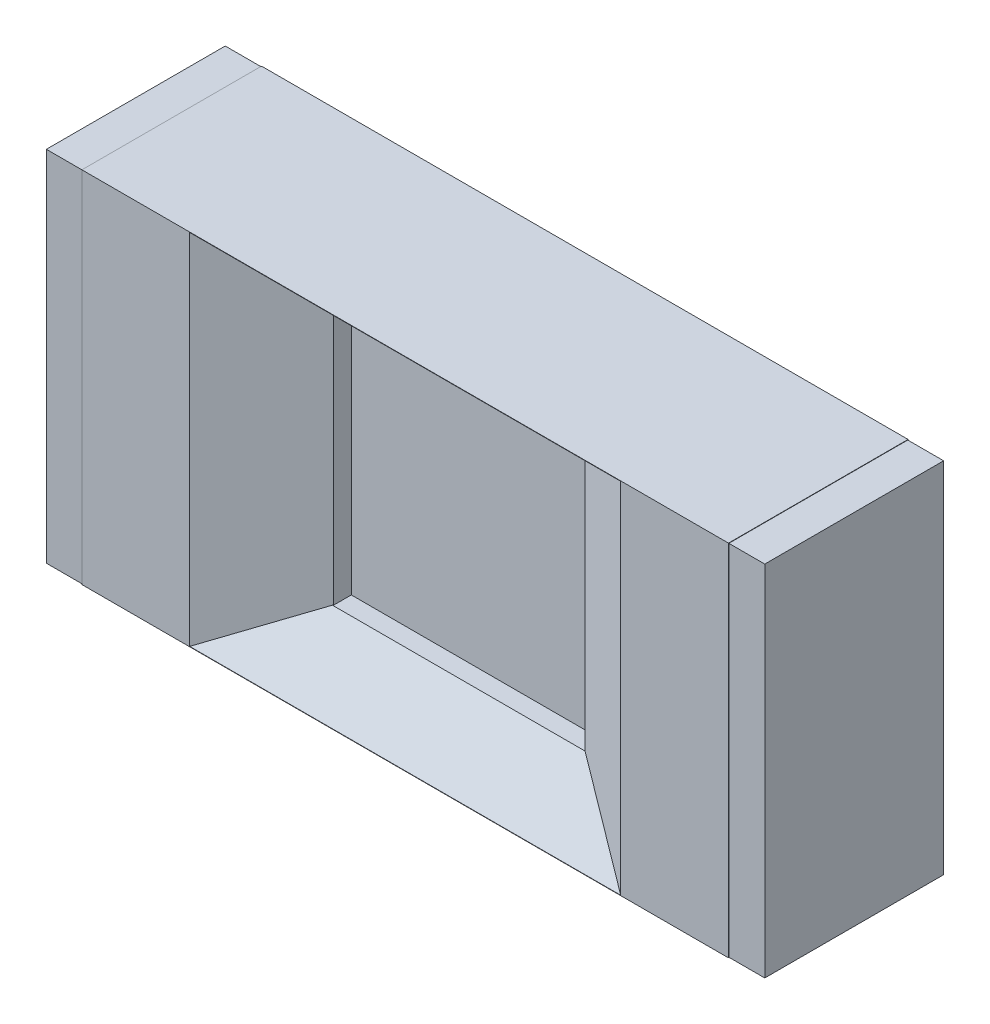
ISO-10303-21;
HEADER;
FILE_DESCRIPTION(('STEP AP214'),'2;1');
FILE_NAME('part.step','',(''),(''),'','','');
FILE_SCHEMA(('AUTOMOTIVE_DESIGN { 1 0 10303 214 1 1 1 1 }'));
ENDSEC;
DATA;
#1=APPLICATION_CONTEXT('core data for automotive mechanical design processes');
#2=APPLICATION_PROTOCOL_DEFINITION('international standard','automotive_design',2000,#1);
#3=PRODUCT_CONTEXT('',#1,'mechanical');
#4=PRODUCT('Part','Part','',(#3));
#5=PRODUCT_RELATED_PRODUCT_CATEGORY('part','',(#4));
#6=PRODUCT_DEFINITION_FORMATION('','',#4);
#7=PRODUCT_DEFINITION_CONTEXT('part definition',#1,'design');
#8=PRODUCT_DEFINITION('design','',#6,#7);
#9=PRODUCT_DEFINITION_SHAPE('','',#8);
#10=(LENGTH_UNIT() NAMED_UNIT(*) SI_UNIT(.MILLI.,.METRE.));
#11=(NAMED_UNIT(*) PLANE_ANGLE_UNIT() SI_UNIT($,.RADIAN.));
#12=(NAMED_UNIT(*) SI_UNIT($,.STERADIAN.) SOLID_ANGLE_UNIT());
#13=UNCERTAINTY_MEASURE_WITH_UNIT(LENGTH_MEASURE(1.E-05),#10,'distance_accuracy_value','');
#14=(GEOMETRIC_REPRESENTATION_CONTEXT(3) GLOBAL_UNCERTAINTY_ASSIGNED_CONTEXT((#13)) GLOBAL_UNIT_ASSIGNED_CONTEXT((#10,
#11,#12)) REPRESENTATION_CONTEXT('',''));
#15=CARTESIAN_POINT('',(0.,0.,0.));
#16=DIRECTION('',(0.,0.,1.));
#17=DIRECTION('',(1.,0.,0.));
#18=AXIS2_PLACEMENT_3D('',#15,#16,#17);
#19=CARTESIAN_POINT('',(28.13,-12.,3.201));
#20=DIRECTION('',(0.,0.,-1.));
#21=DIRECTION('',(0.,-1.,0.));
#22=AXIS2_PLACEMENT_3D('',#19,#20,#21);
#23=PLANE('',#22);
#24=DIRECTION('',(1.,0.,0.));
#25=VECTOR('',#24,1.);
#26=CARTESIAN_POINT('',(28.13,-11.999,3.201));
#27=LINE('',#26,#25);
#28=CARTESIAN_POINT('',(28.03,-11.999,3.201));
#29=VERTEX_POINT('',#28);
#30=CARTESIAN_POINT('',(28.13,-11.999,3.201));
#31=VERTEX_POINT('',#30);
#32=EDGE_CURVE('E257',#29,#31,#27,.T.);
#33=ORIENTED_EDGE('',*,*,#32,.F.);
#34=DIRECTION('',(0.,-1.,0.));
#35=VECTOR('',#34,1.);
#36=CARTESIAN_POINT('',(28.03,-12.,3.201));
#37=LINE('',#36,#35);
#38=CARTESIAN_POINT('',(28.03,-11.001,3.201));
#39=VERTEX_POINT('',#38);
#40=EDGE_CURVE('E11',#39,#29,#37,.T.);
#41=ORIENTED_EDGE('',*,*,#40,.F.);
#42=DIRECTION('',(1.,0.,0.));
#43=VECTOR('',#42,1.);
#44=CARTESIAN_POINT('',(28.13,-11.001,3.201));
#45=LINE('',#44,#43);
#46=CARTESIAN_POINT('',(28.13,-11.001,3.201));
#47=VERTEX_POINT('',#46);
#48=EDGE_CURVE('E260',#39,#47,#45,.T.);
#49=ORIENTED_EDGE('',*,*,#48,.T.);
#50=DIRECTION('',(0.,-1.,0.));
#51=VECTOR('',#50,1.);
#52=CARTESIAN_POINT('',(28.13,-12.,3.201));
#53=LINE('',#52,#51);
#54=EDGE_CURVE('E288',#47,#31,#53,.T.);
#55=ORIENTED_EDGE('',*,*,#54,.T.);
#56=EDGE_LOOP('',(#33,#41,#49,#55));
#57=FACE_BOUND('',#56,.T.);
#58=ADVANCED_FACE('F18',(#57),#23,.T.);
#59=CARTESIAN_POINT('',(28.03,-12.,3.2));
#60=DIRECTION('',(-1.,0.,0.));
#61=DIRECTION('',(0.,0.,1.));
#62=AXIS2_PLACEMENT_3D('',#59,#60,#61);
#63=PLANE('',#62);
#64=ORIENTED_EDGE('',*,*,#40,.T.);
#65=DIRECTION('',(0.,0.,1.));
#66=VECTOR('',#65,1.);
#67=CARTESIAN_POINT('',(28.03,-11.999,3.2));
#68=LINE('',#67,#66);
#69=CARTESIAN_POINT('',(28.03,-11.999,3.699));
#70=VERTEX_POINT('',#69);
#71=EDGE_CURVE('E261',#29,#70,#68,.T.);
#72=ORIENTED_EDGE('',*,*,#71,.T.);
#73=DIRECTION('',(0.,1.,0.));
#74=VECTOR('',#73,1.);
#75=CARTESIAN_POINT('',(28.03,-12.,3.699));
#76=LINE('',#75,#74);
#77=CARTESIAN_POINT('',(28.03,-11.001,3.699));
#78=VERTEX_POINT('',#77);
#79=EDGE_CURVE('E298',#70,#78,#76,.T.);
#80=ORIENTED_EDGE('',*,*,#79,.T.);
#81=DIRECTION('',(0.,0.,-1.));
#82=VECTOR('',#81,1.);
#83=CARTESIAN_POINT('',(28.03,-11.001,3.2));
#84=LINE('',#83,#82);
#85=EDGE_CURVE('E28',#78,#39,#84,.T.);
#86=ORIENTED_EDGE('',*,*,#85,.T.);
#87=EDGE_LOOP('',(#64,#72,#80,#86));
#88=FACE_BOUND('',#87,.T.);
#89=ADVANCED_FACE('F487',(#88),#63,.T.);
#90=CARTESIAN_POINT('',(28.13,-11.001,3.2));
#91=DIRECTION('',(0.,1.,0.));
#92=DIRECTION('',(1.,0.,0.));
#93=AXIS2_PLACEMENT_3D('',#90,#91,#92);
#94=PLANE('',#93);
#95=ORIENTED_EDGE('',*,*,#48,.F.);
#96=ORIENTED_EDGE('',*,*,#85,.F.);
#97=DIRECTION('',(1.,0.,0.));
#98=VECTOR('',#97,1.);
#99=CARTESIAN_POINT('',(28.13,-11.001,3.699));
#100=LINE('',#99,#98);
#101=CARTESIAN_POINT('',(28.13,-11.001,3.699));
#102=VERTEX_POINT('',#101);
#103=EDGE_CURVE('E295',#78,#102,#100,.T.);
#104=ORIENTED_EDGE('',*,*,#103,.T.);
#105=DIRECTION('',(0.,0.,-1.));
#106=VECTOR('',#105,1.);
#107=CARTESIAN_POINT('',(28.13,-11.001,3.2));
#108=LINE('',#107,#106);
#109=EDGE_CURVE('E299',#102,#47,#108,.T.);
#110=ORIENTED_EDGE('',*,*,#109,.T.);
#111=EDGE_LOOP('',(#95,#96,#104,#110));
#112=FACE_BOUND('',#111,.T.);
#113=ADVANCED_FACE('F490',(#112),#94,.T.);
#114=CARTESIAN_POINT('',(28.13,-11.999,3.2));
#115=DIRECTION('',(0.,-1.,0.));
#116=DIRECTION('',(-1.,0.,0.));
#117=AXIS2_PLACEMENT_3D('',#114,#115,#116);
#118=PLANE('',#117);
#119=DIRECTION('',(1.,0.,0.));
#120=VECTOR('',#119,1.);
#121=CARTESIAN_POINT('',(28.13,-11.999,3.699));
#122=LINE('',#121,#120);
#123=CARTESIAN_POINT('',(28.13,-11.999,3.699));
#124=VERTEX_POINT('',#123);
#125=EDGE_CURVE('E267',#70,#124,#122,.T.);
#126=ORIENTED_EDGE('',*,*,#125,.F.);
#127=ORIENTED_EDGE('',*,*,#71,.F.);
#128=ORIENTED_EDGE('',*,*,#32,.T.);
#129=DIRECTION('',(0.,0.,1.));
#130=VECTOR('',#129,1.);
#131=CARTESIAN_POINT('',(28.13,-11.999,3.2));
#132=LINE('',#131,#130);
#133=EDGE_CURVE('E284',#31,#124,#132,.T.);
#134=ORIENTED_EDGE('',*,*,#133,.T.);
#135=EDGE_LOOP('',(#126,#127,#128,#134));
#136=FACE_BOUND('',#135,.T.);
#137=ADVANCED_FACE('F498',(#136),#118,.T.);
#138=CARTESIAN_POINT('',(28.13,-12.,3.699));
#139=DIRECTION('',(0.,0.,1.));
#140=DIRECTION('',(1.,0.,0.));
#141=AXIS2_PLACEMENT_3D('',#138,#139,#140);
#142=PLANE('',#141);
#143=ORIENTED_EDGE('',*,*,#103,.F.);
#144=ORIENTED_EDGE('',*,*,#79,.F.);
#145=ORIENTED_EDGE('',*,*,#125,.T.);
#146=DIRECTION('',(0.,1.,0.));
#147=VECTOR('',#146,1.);
#148=CARTESIAN_POINT('',(28.13,-12.,3.699));
#149=LINE('',#148,#147);
#150=EDGE_CURVE('E279',#124,#102,#149,.T.);
#151=ORIENTED_EDGE('',*,*,#150,.T.);
#152=EDGE_LOOP('',(#143,#144,#145,#151));
#153=FACE_BOUND('',#152,.T.);
#154=ADVANCED_FACE('F507',(#153),#142,.T.);
#155=CARTESIAN_POINT('',(28.13,-11.5,3.45));
#156=DIRECTION('',(-1.,0.,0.));
#157=DIRECTION('',(0.,0.,1.));
#158=AXIS2_PLACEMENT_3D('',#155,#156,#157);
#159=PLANE('',#158);
#160=ORIENTED_EDGE('',*,*,#150,.F.);
#161=ORIENTED_EDGE('',*,*,#133,.F.);
#162=ORIENTED_EDGE('',*,*,#54,.F.);
#163=ORIENTED_EDGE('',*,*,#109,.F.);
#164=EDGE_LOOP('',(#160,#161,#162,#163));
#165=FACE_BOUND('',#164,.T.);
#166=DIRECTION('',(0.,1.,0.));
#167=VECTOR('',#166,1.);
#168=CARTESIAN_POINT('',(28.13,-12.,3.7));
#169=LINE('',#168,#167);
#170=CARTESIAN_POINT('',(28.13,-12.,3.7));
#171=VERTEX_POINT('',#170);
#172=CARTESIAN_POINT('',(28.13,-11.,3.7));
#173=VERTEX_POINT('',#172);
#174=EDGE_CURVE('E334',#171,#173,#169,.T.);
#175=ORIENTED_EDGE('',*,*,#174,.T.);
#176=DIRECTION('',(0.,0.,-1.));
#177=VECTOR('',#176,1.);
#178=CARTESIAN_POINT('',(28.13,-11.,3.2));
#179=LINE('',#178,#177);
#180=CARTESIAN_POINT('',(28.13,-11.,3.2));
#181=VERTEX_POINT('',#180);
#182=EDGE_CURVE('E186',#173,#181,#179,.T.);
#183=ORIENTED_EDGE('',*,*,#182,.T.);
#184=DIRECTION('',(0.,-1.,0.));
#185=VECTOR('',#184,1.);
#186=CARTESIAN_POINT('',(28.13,-12.,3.2));
#187=LINE('',#186,#185);
#188=CARTESIAN_POINT('',(28.13,-12.,3.2));
#189=VERTEX_POINT('',#188);
#190=EDGE_CURVE('E321',#181,#189,#187,.T.);
#191=ORIENTED_EDGE('',*,*,#190,.T.);
#192=DIRECTION('',(0.,0.,1.));
#193=VECTOR('',#192,1.);
#194=CARTESIAN_POINT('',(28.13,-12.,3.2));
#195=LINE('',#194,#193);
#196=EDGE_CURVE('E196',#189,#171,#195,.T.);
#197=ORIENTED_EDGE('',*,*,#196,.T.);
#198=EDGE_LOOP('',(#175,#183,#191,#197));
#199=FACE_BOUND('',#198,.T.);
#200=ADVANCED_FACE('F473',(#165,#199),#159,.T.);
#201=CARTESIAN_POINT('',(29.93,-12.,3.201));
#202=DIRECTION('',(0.,0.,-1.));
#203=DIRECTION('',(-1.,0.,0.));
#204=AXIS2_PLACEMENT_3D('',#201,#202,#203);
#205=PLANE('',#204);
#206=DIRECTION('',(0.,-1.,0.));
#207=VECTOR('',#206,1.);
#208=CARTESIAN_POINT('',(29.93,-12.,3.201));
#209=LINE('',#208,#207);
#210=CARTESIAN_POINT('',(29.93,-11.001,3.201));
#211=VERTEX_POINT('',#210);
#212=CARTESIAN_POINT('',(29.93,-11.999,3.201));
#213=VERTEX_POINT('',#212);
#214=EDGE_CURVE('E275',#211,#213,#209,.T.);
#215=ORIENTED_EDGE('',*,*,#214,.F.);
#216=DIRECTION('',(-1.,0.,0.));
#217=VECTOR('',#216,1.);
#218=CARTESIAN_POINT('',(29.93,-11.001,3.201));
#219=LINE('',#218,#217);
#220=CARTESIAN_POINT('',(30.03,-11.001,3.201));
#221=VERTEX_POINT('',#220);
#222=EDGE_CURVE('E280',#221,#211,#219,.T.);
#223=ORIENTED_EDGE('',*,*,#222,.F.);
#224=DIRECTION('',(0.,-1.,0.));
#225=VECTOR('',#224,1.);
#226=CARTESIAN_POINT('',(30.03,-12.,3.201));
#227=LINE('',#226,#225);
#228=CARTESIAN_POINT('',(30.03,-11.999,3.201));
#229=VERTEX_POINT('',#228);
#230=EDGE_CURVE('E276',#221,#229,#227,.T.);
#231=ORIENTED_EDGE('',*,*,#230,.T.);
#232=DIRECTION('',(-1.,0.,0.));
#233=VECTOR('',#232,1.);
#234=CARTESIAN_POINT('',(29.93,-11.999,3.201));
#235=LINE('',#234,#233);
#236=EDGE_CURVE('E300',#229,#213,#235,.T.);
#237=ORIENTED_EDGE('',*,*,#236,.T.);
#238=EDGE_LOOP('',(#215,#223,#231,#237));
#239=FACE_BOUND('',#238,.T.);
#240=ADVANCED_FACE('F514',(#239),#205,.T.);
#241=CARTESIAN_POINT('',(30.03,-11.,3.2));
#242=DIRECTION('',(1.,0.,0.));
#243=DIRECTION('',(0.,1.,0.));
#244=AXIS2_PLACEMENT_3D('',#241,#242,#243);
#245=PLANE('',#244);
#246=ORIENTED_EDGE('',*,*,#230,.F.);
#247=DIRECTION('',(0.,0.,-1.));
#248=VECTOR('',#247,1.);
#249=CARTESIAN_POINT('',(30.03,-11.001,3.2));
#250=LINE('',#249,#248);
#251=CARTESIAN_POINT('',(30.03,-11.001,3.699));
#252=VERTEX_POINT('',#251);
#253=EDGE_CURVE('E400',#252,#221,#250,.T.);
#254=ORIENTED_EDGE('',*,*,#253,.F.);
#255=DIRECTION('',(0.,1.,0.));
#256=VECTOR('',#255,1.);
#257=CARTESIAN_POINT('',(30.03,-12.,3.699));
#258=LINE('',#257,#256);
#259=CARTESIAN_POINT('',(30.03,-11.999,3.699));
#260=VERTEX_POINT('',#259);
#261=EDGE_CURVE('E308',#260,#252,#258,.T.);
#262=ORIENTED_EDGE('',*,*,#261,.F.);
#263=DIRECTION('',(0.,0.,1.));
#264=VECTOR('',#263,1.);
#265=CARTESIAN_POINT('',(30.03,-11.999,3.2));
#266=LINE('',#265,#264);
#267=EDGE_CURVE('E21',#229,#260,#266,.T.);
#268=ORIENTED_EDGE('',*,*,#267,.F.);
#269=EDGE_LOOP('',(#246,#254,#262,#268));
#270=FACE_BOUND('',#269,.T.);
#271=ADVANCED_FACE('F534',(#270),#245,.T.);
#272=CARTESIAN_POINT('',(29.93,-11.001,3.2));
#273=DIRECTION('',(0.,1.,0.));
#274=DIRECTION('',(1.,0.,0.));
#275=AXIS2_PLACEMENT_3D('',#272,#273,#274);
#276=PLANE('',#275);
#277=DIRECTION('',(0.,0.,-1.));
#278=VECTOR('',#277,1.);
#279=CARTESIAN_POINT('',(29.93,-11.001,3.2));
#280=LINE('',#279,#278);
#281=CARTESIAN_POINT('',(29.93,-11.001,3.699));
#282=VERTEX_POINT('',#281);
#283=EDGE_CURVE('E342',#282,#211,#280,.T.);
#284=ORIENTED_EDGE('',*,*,#283,.F.);
#285=DIRECTION('',(-1.,0.,0.));
#286=VECTOR('',#285,1.);
#287=CARTESIAN_POINT('',(29.93,-11.001,3.699));
#288=LINE('',#287,#286);
#289=EDGE_CURVE('E303',#252,#282,#288,.T.);
#290=ORIENTED_EDGE('',*,*,#289,.F.);
#291=ORIENTED_EDGE('',*,*,#253,.T.);
#292=ORIENTED_EDGE('',*,*,#222,.T.);
#293=EDGE_LOOP('',(#284,#290,#291,#292));
#294=FACE_BOUND('',#293,.T.);
#295=ADVANCED_FACE('F537',(#294),#276,.T.);
#296=CARTESIAN_POINT('',(29.93,-11.999,3.2));
#297=DIRECTION('',(0.,-1.,0.));
#298=DIRECTION('',(0.,0.,-1.));
#299=AXIS2_PLACEMENT_3D('',#296,#297,#298);
#300=PLANE('',#299);
#301=DIRECTION('',(0.,0.,1.));
#302=VECTOR('',#301,1.);
#303=CARTESIAN_POINT('',(29.93,-11.999,3.2));
#304=LINE('',#303,#302);
#305=CARTESIAN_POINT('',(29.93,-11.999,3.699));
#306=VERTEX_POINT('',#305);
#307=EDGE_CURVE('E270',#213,#306,#304,.T.);
#308=ORIENTED_EDGE('',*,*,#307,.F.);
#309=ORIENTED_EDGE('',*,*,#236,.F.);
#310=ORIENTED_EDGE('',*,*,#267,.T.);
#311=DIRECTION('',(-1.,0.,0.));
#312=VECTOR('',#311,1.);
#313=CARTESIAN_POINT('',(29.93,-11.999,3.699));
#314=LINE('',#313,#312);
#315=EDGE_CURVE('E274',#260,#306,#314,.T.);
#316=ORIENTED_EDGE('',*,*,#315,.T.);
#317=EDGE_LOOP('',(#308,#309,#310,#316));
#318=FACE_BOUND('',#317,.T.);
#319=ADVANCED_FACE('F518',(#318),#300,.T.);
#320=CARTESIAN_POINT('',(29.93,-12.,3.699));
#321=DIRECTION('',(0.,0.,1.));
#322=DIRECTION('',(1.,0.,0.));
#323=AXIS2_PLACEMENT_3D('',#320,#321,#322);
#324=PLANE('',#323);
#325=DIRECTION('',(0.,1.,0.));
#326=VECTOR('',#325,1.);
#327=CARTESIAN_POINT('',(29.93,-12.,3.699));
#328=LINE('',#327,#326);
#329=EDGE_CURVE('E347',#306,#282,#328,.T.);
#330=ORIENTED_EDGE('',*,*,#329,.F.);
#331=ORIENTED_EDGE('',*,*,#315,.F.);
#332=ORIENTED_EDGE('',*,*,#261,.T.);
#333=ORIENTED_EDGE('',*,*,#289,.T.);
#334=EDGE_LOOP('',(#330,#331,#332,#333));
#335=FACE_BOUND('',#334,.T.);
#336=ADVANCED_FACE('F546',(#335),#324,.T.);
#337=CARTESIAN_POINT('',(29.93,-11.5,3.45));
#338=DIRECTION('',(1.,0.,0.));
#339=DIRECTION('',(0.,1.,0.));
#340=AXIS2_PLACEMENT_3D('',#337,#338,#339);
#341=PLANE('',#340);
#342=ORIENTED_EDGE('',*,*,#329,.T.);
#343=ORIENTED_EDGE('',*,*,#283,.T.);
#344=ORIENTED_EDGE('',*,*,#214,.T.);
#345=ORIENTED_EDGE('',*,*,#307,.T.);
#346=EDGE_LOOP('',(#342,#343,#344,#345));
#347=FACE_BOUND('',#346,.T.);
#348=DIRECTION('',(0.,1.,0.));
#349=VECTOR('',#348,1.);
#350=CARTESIAN_POINT('',(29.93,-12.,3.7));
#351=LINE('',#350,#349);
#352=CARTESIAN_POINT('',(29.93,-12.,3.7));
#353=VERTEX_POINT('',#352);
#354=CARTESIAN_POINT('',(29.93,-11.,3.7));
#355=VERTEX_POINT('',#354);
#356=EDGE_CURVE('E312',#353,#355,#351,.T.);
#357=ORIENTED_EDGE('',*,*,#356,.F.);
#358=DIRECTION('',(0.,0.,1.));
#359=VECTOR('',#358,1.);
#360=CARTESIAN_POINT('',(29.93,-12.,3.2));
#361=LINE('',#360,#359);
#362=CARTESIAN_POINT('',(29.93,-12.,3.2));
#363=VERTEX_POINT('',#362);
#364=EDGE_CURVE('E293',#363,#353,#361,.T.);
#365=ORIENTED_EDGE('',*,*,#364,.F.);
#366=DIRECTION('',(0.,-1.,0.));
#367=VECTOR('',#366,1.);
#368=CARTESIAN_POINT('',(29.93,-12.,3.2));
#369=LINE('',#368,#367);
#370=CARTESIAN_POINT('',(29.93,-11.,3.2));
#371=VERTEX_POINT('',#370);
#372=EDGE_CURVE('E221',#371,#363,#369,.T.);
#373=ORIENTED_EDGE('',*,*,#372,.F.);
#374=DIRECTION('',(0.,0.,-1.));
#375=VECTOR('',#374,1.);
#376=CARTESIAN_POINT('',(29.93,-11.,3.2));
#377=LINE('',#376,#375);
#378=EDGE_CURVE('E178',#355,#371,#377,.T.);
#379=ORIENTED_EDGE('',*,*,#378,.F.);
#380=EDGE_LOOP('',(#357,#365,#373,#379));
#381=FACE_BOUND('',#380,.T.);
#382=ADVANCED_FACE('F467',(#347,#381),#341,.T.);
#383=CARTESIAN_POINT('',(29.03,-11.5,3.5));
#384=DIRECTION('',(0.,0.,-1.));
#385=DIRECTION('',(0.,-1.,0.));
#386=AXIS2_PLACEMENT_3D('',#383,#384,#385);
#387=PLANE('',#386);
#388=DIRECTION('',(0.,1.,0.));
#389=VECTOR('',#388,1.);
#390=CARTESIAN_POINT('',(28.68,-11.85,3.5));
#391=LINE('',#390,#389);
#392=CARTESIAN_POINT('',(28.68,-11.85,3.5));
#393=VERTEX_POINT('',#392);
#394=CARTESIAN_POINT('',(28.68,-11.15,3.5));
#395=VERTEX_POINT('',#394);
#396=EDGE_CURVE('E215',#393,#395,#391,.T.);
#397=ORIENTED_EDGE('',*,*,#396,.F.);
#398=DIRECTION('',(-1.,0.,0.));
#399=VECTOR('',#398,1.);
#400=CARTESIAN_POINT('',(29.38,-11.85,3.5));
#401=LINE('',#400,#399);
#402=CARTESIAN_POINT('',(29.38,-11.85,3.5));
#403=VERTEX_POINT('',#402);
#404=EDGE_CURVE('E339',#403,#393,#401,.T.);
#405=ORIENTED_EDGE('',*,*,#404,.F.);
#406=DIRECTION('',(0.,-1.,0.));
#407=VECTOR('',#406,1.);
#408=CARTESIAN_POINT('',(29.38,-11.15,3.5));
#409=LINE('',#408,#407);
#410=CARTESIAN_POINT('',(29.38,-11.15,3.5));
#411=VERTEX_POINT('',#410);
#412=EDGE_CURVE('E350',#411,#403,#409,.T.);
#413=ORIENTED_EDGE('',*,*,#412,.F.);
#414=DIRECTION('',(1.,0.,0.));
#415=VECTOR('',#414,1.);
#416=CARTESIAN_POINT('',(28.68,-11.15,3.5));
#417=LINE('',#416,#415);
#418=EDGE_CURVE('E220',#395,#411,#417,.T.);
#419=ORIENTED_EDGE('',*,*,#418,.F.);
#420=EDGE_LOOP('',(#397,#405,#413,#419));
#421=FACE_BOUND('',#420,.T.);
#422=ADVANCED_FACE('F452',(#421),#387,.F.);
#423=CARTESIAN_POINT('',(29.38,-11.15,3.7));
#424=DIRECTION('',(-1.,0.,0.));
#425=DIRECTION('',(0.,0.,1.));
#426=AXIS2_PLACEMENT_3D('',#423,#424,#425);
#427=PLANE('',#426);
#428=DIRECTION('',(0.,0.,-1.));
#429=VECTOR('',#428,1.);
#430=CARTESIAN_POINT('',(29.38,-11.15,3.7));
#431=LINE('',#430,#429);
#432=CARTESIAN_POINT('',(29.38,-11.15,3.55));
#433=VERTEX_POINT('',#432);
#434=EDGE_CURVE('E329',#433,#411,#431,.T.);
#435=ORIENTED_EDGE('',*,*,#434,.T.);
#436=ORIENTED_EDGE('',*,*,#412,.T.);
#437=DIRECTION('',(0.,0.,-1.));
#438=VECTOR('',#437,1.);
#439=CARTESIAN_POINT('',(29.38,-11.85,3.7));
#440=LINE('',#439,#438);
#441=CARTESIAN_POINT('',(29.38,-11.85,3.55));
#442=VERTEX_POINT('',#441);
#443=EDGE_CURVE('E335',#442,#403,#440,.T.);
#444=ORIENTED_EDGE('',*,*,#443,.F.);
#445=DIRECTION('',(0.,-1.,0.));
#446=VECTOR('',#445,1.);
#447=CARTESIAN_POINT('',(29.38,-11.15,3.55));
#448=LINE('',#447,#446);
#449=EDGE_CURVE('E249',#433,#442,#448,.T.);
#450=ORIENTED_EDGE('',*,*,#449,.F.);
#451=EDGE_LOOP('',(#435,#436,#444,#450));
#452=FACE_BOUND('',#451,.T.);
#453=ADVANCED_FACE('F449',(#452),#427,.T.);
#454=CARTESIAN_POINT('',(28.68,-11.85,3.7));
#455=DIRECTION('',(1.,0.,0.));
#456=DIRECTION('',(0.,1.,0.));
#457=AXIS2_PLACEMENT_3D('',#454,#455,#456);
#458=PLANE('',#457);
#459=DIRECTION('',(0.,0.,-1.));
#460=VECTOR('',#459,1.);
#461=CARTESIAN_POINT('',(28.68,-11.85,3.7));
#462=LINE('',#461,#460);
#463=CARTESIAN_POINT('',(28.68,-11.85,3.55));
#464=VERTEX_POINT('',#463);
#465=EDGE_CURVE('E363',#464,#393,#462,.T.);
#466=ORIENTED_EDGE('',*,*,#465,.T.);
#467=ORIENTED_EDGE('',*,*,#396,.T.);
#468=DIRECTION('',(0.,0.,-1.));
#469=VECTOR('',#468,1.);
#470=CARTESIAN_POINT('',(28.68,-11.15,3.7));
#471=LINE('',#470,#469);
#472=CARTESIAN_POINT('',(28.68,-11.15,3.55));
#473=VERTEX_POINT('',#472);
#474=EDGE_CURVE('E209',#473,#395,#471,.T.);
#475=ORIENTED_EDGE('',*,*,#474,.F.);
#476=DIRECTION('',(0.,1.,0.));
#477=VECTOR('',#476,1.);
#478=CARTESIAN_POINT('',(28.68,-11.85,3.55));
#479=LINE('',#478,#477);
#480=EDGE_CURVE('E214',#464,#473,#479,.T.);
#481=ORIENTED_EDGE('',*,*,#480,.F.);
#482=EDGE_LOOP('',(#466,#467,#475,#481));
#483=FACE_BOUND('',#482,.T.);
#484=ADVANCED_FACE('F212',(#483),#458,.T.);
#485=CARTESIAN_POINT('',(29.38,-11.85,3.7));
#486=DIRECTION('',(0.,1.,0.));
#487=DIRECTION('',(1.,0.,0.));
#488=AXIS2_PLACEMENT_3D('',#485,#486,#487);
#489=PLANE('',#488);
#490=DIRECTION('',(-0.857492925712456,0.,-0.514495755427674));
#491=VECTOR('',#490,1.);
#492=CARTESIAN_POINT('',(29.475588235294,-11.85,3.607352941176));
#493=LINE('',#492,#491);
#494=CARTESIAN_POINT('',(29.381666666666,-11.85,3.551));
#495=VERTEX_POINT('',#494);
#496=EDGE_CURVE('E304',#495,#442,#493,.T.);
#497=ORIENTED_EDGE('',*,*,#496,.T.);
#498=ORIENTED_EDGE('',*,*,#443,.T.);
#499=ORIENTED_EDGE('',*,*,#404,.T.);
#500=ORIENTED_EDGE('',*,*,#465,.F.);
#501=DIRECTION('',(0.857492925712456,0.,-0.514495755427674));
#502=VECTOR('',#501,1.);
#503=CARTESIAN_POINT('',(28.841764705882,-11.85,3.452941176471));
#504=LINE('',#503,#502);
#505=CARTESIAN_POINT('',(28.678333333333,-11.85,3.551));
#506=VERTEX_POINT('',#505);
#507=EDGE_CURVE('E237',#506,#464,#504,.T.);
#508=ORIENTED_EDGE('',*,*,#507,.F.);
#509=DIRECTION('',(-1.,0.,0.));
#510=VECTOR('',#509,1.);
#511=CARTESIAN_POINT('',(28.68,-11.85,3.551));
#512=LINE('',#511,#510);
#513=EDGE_CURVE('E255',#495,#506,#512,.T.);
#514=ORIENTED_EDGE('',*,*,#513,.F.);
#515=EDGE_LOOP('',(#497,#498,#499,#500,#508,#514));
#516=FACE_BOUND('',#515,.T.);
#517=ADVANCED_FACE('F361',(#516),#489,.T.);
#518=CARTESIAN_POINT('',(28.68,-11.15,3.7));
#519=DIRECTION('',(0.,-1.,0.));
#520=DIRECTION('',(0.,0.,-1.));
#521=AXIS2_PLACEMENT_3D('',#518,#519,#520);
#522=PLANE('',#521);
#523=DIRECTION('',(0.857492925712456,0.,-0.514495755427674));
#524=VECTOR('',#523,1.);
#525=CARTESIAN_POINT('',(28.584411764705,-11.15,3.607352941176));
#526=LINE('',#525,#524);
#527=CARTESIAN_POINT('',(28.678333333333,-11.15,3.551));
#528=VERTEX_POINT('',#527);
#529=EDGE_CURVE('E224',#528,#473,#526,.T.);
#530=ORIENTED_EDGE('',*,*,#529,.T.);
#531=ORIENTED_EDGE('',*,*,#474,.T.);
#532=ORIENTED_EDGE('',*,*,#418,.T.);
#533=ORIENTED_EDGE('',*,*,#434,.F.);
#534=DIRECTION('',(-0.857492925712456,0.,-0.514495755427674));
#535=VECTOR('',#534,1.);
#536=CARTESIAN_POINT('',(29.218235294117,-11.15,3.452941176471));
#537=LINE('',#536,#535);
#538=CARTESIAN_POINT('',(29.381666666666,-11.15,3.551));
#539=VERTEX_POINT('',#538);
#540=EDGE_CURVE('E251',#539,#433,#537,.T.);
#541=ORIENTED_EDGE('',*,*,#540,.F.);
#542=DIRECTION('',(1.,0.,0.));
#543=VECTOR('',#542,1.);
#544=CARTESIAN_POINT('',(29.38,-11.15,3.551));
#545=LINE('',#544,#543);
#546=EDGE_CURVE('E227',#528,#539,#545,.T.);
#547=ORIENTED_EDGE('',*,*,#546,.F.);
#548=EDGE_LOOP('',(#530,#531,#532,#533,#541,#547));
#549=FACE_BOUND('',#548,.T.);
#550=ADVANCED_FACE('F225',(#549),#522,.T.);
#551=CARTESIAN_POINT('',(29.03,-11.5,3.2));
#552=DIRECTION('',(0.,0.,-1.));
#553=DIRECTION('',(0.,-1.,0.));
#554=AXIS2_PLACEMENT_3D('',#551,#552,#553);
#555=PLANE('',#554);
#556=DIRECTION('',(-1.,0.,0.));
#557=VECTOR('',#556,1.);
#558=CARTESIAN_POINT('',(30.03,-12.,3.2));
#559=LINE('',#558,#557);
#560=EDGE_CURVE('E289',#363,#189,#559,.T.);
#561=ORIENTED_EDGE('',*,*,#560,.T.);
#562=ORIENTED_EDGE('',*,*,#190,.F.);
#563=DIRECTION('',(1.,0.,0.));
#564=VECTOR('',#563,1.);
#565=CARTESIAN_POINT('',(28.03,-11.,3.2));
#566=LINE('',#565,#564);
#567=EDGE_CURVE('E264',#181,#371,#566,.T.);
#568=ORIENTED_EDGE('',*,*,#567,.T.);
#569=ORIENTED_EDGE('',*,*,#372,.T.);
#570=EDGE_LOOP('',(#561,#562,#568,#569));
#571=FACE_BOUND('',#570,.T.);
#572=ADVANCED_FACE('F465',(#571),#555,.T.);
#573=CARTESIAN_POINT('',(29.03,-11.93898373043,3.639983730433));
#574=DIRECTION('',(0.,0.707106781186548,0.707106781186548));
#575=DIRECTION('',(1.,0.,0.));
#576=AXIS2_PLACEMENT_3D('',#573,#574,#575);
#577=PLANE('',#576);
#578=DIRECTION('',(-1.,0.,0.));
#579=VECTOR('',#578,1.);
#580=CARTESIAN_POINT('',(29.63,-11.999,3.7));
#581=LINE('',#580,#579);
#582=CARTESIAN_POINT('',(29.63,-11.999,3.7));
#583=VERTEX_POINT('',#582);
#584=CARTESIAN_POINT('',(28.43,-11.999,3.7));
#585=VERTEX_POINT('',#584);
#586=EDGE_CURVE('E371',#583,#585,#581,.T.);
#587=ORIENTED_EDGE('',*,*,#586,.F.);
#588=DIRECTION('',(-0.762492851662884,0.45749571099793,-0.45749571099793));
#589=VECTOR('',#588,1.);
#590=CARTESIAN_POINT('',(29.406511627907,-11.86490697674,3.565906976744));
#591=LINE('',#590,#589);
#592=EDGE_CURVE('E256',#583,#495,#591,.T.);
#593=ORIENTED_EDGE('',*,*,#592,.T.);
#594=ORIENTED_EDGE('',*,*,#513,.T.);
#595=DIRECTION('',(0.762492851662884,0.45749571099793,-0.45749571099793));
#596=VECTOR('',#595,1.);
#597=CARTESIAN_POINT('',(28.604069767441,-11.89455813953,3.595558139535));
#598=LINE('',#597,#596);
#599=EDGE_CURVE('E231',#585,#506,#598,.T.);
#600=ORIENTED_EDGE('',*,*,#599,.F.);
#601=EDGE_LOOP('',(#587,#593,#594,#600));
#602=FACE_BOUND('',#601,.T.);
#603=ADVANCED_FACE('F357',(#602),#577,.T.);
#604=CARTESIAN_POINT('',(29.505,-11.15,3.625));
#605=DIRECTION('',(0.514495755427674,0.,-0.857492925712456));
#606=DIRECTION('',(0.,-1.,0.));
#607=AXIS2_PLACEMENT_3D('',#604,#605,#606);
#608=PLANE('',#607);
#609=ORIENTED_EDGE('',*,*,#449,.T.);
#610=ORIENTED_EDGE('',*,*,#496,.F.);
#611=ORIENTED_EDGE('',*,*,#592,.F.);
#612=DIRECTION('',(0.,1.,0.));
#613=VECTOR('',#612,1.);
#614=CARTESIAN_POINT('',(29.63,-11.325,3.7));
#615=LINE('',#614,#613);
#616=CARTESIAN_POINT('',(29.63,-11.001,3.7));
#617=VERTEX_POINT('',#616);
#618=EDGE_CURVE('E333',#583,#617,#615,.T.);
#619=ORIENTED_EDGE('',*,*,#618,.T.);
#620=DIRECTION('',(-0.762492851662884,-0.45749571099793,-0.45749571099793));
#621=VECTOR('',#620,1.);
#622=CARTESIAN_POINT('',(29.455930232558,-11.10544186046,3.595558139535));
#623=LINE('',#622,#621);
#624=EDGE_CURVE('E239',#617,#539,#623,.T.);
#625=ORIENTED_EDGE('',*,*,#624,.T.);
#626=ORIENTED_EDGE('',*,*,#540,.T.);
#627=EDGE_LOOP('',(#609,#610,#611,#619,#625,#626));
#628=FACE_BOUND('',#627,.T.);
#629=ADVANCED_FACE('F444',(#628),#608,.F.);
#630=CARTESIAN_POINT('',(28.555,-11.85,3.625));
#631=DIRECTION('',(-0.514495755427674,0.,-0.857492925712456));
#632=DIRECTION('',(-0.857492925712456,0.,0.514495755427674));
#633=AXIS2_PLACEMENT_3D('',#630,#631,#632);
#634=PLANE('',#633);
#635=ORIENTED_EDGE('',*,*,#480,.T.);
#636=ORIENTED_EDGE('',*,*,#529,.F.);
#637=DIRECTION('',(0.762492851662884,-0.45749571099793,-0.45749571099793));
#638=VECTOR('',#637,1.);
#639=CARTESIAN_POINT('',(28.653488372093,-11.13509302325,3.565906976744));
#640=LINE('',#639,#638);
#641=CARTESIAN_POINT('',(28.43,-11.001,3.7));
#642=VERTEX_POINT('',#641);
#643=EDGE_CURVE('E282',#642,#528,#640,.T.);
#644=ORIENTED_EDGE('',*,*,#643,.F.);
#645=DIRECTION('',(0.,-1.,0.));
#646=VECTOR('',#645,1.);
#647=CARTESIAN_POINT('',(28.43,-11.675,3.7));
#648=LINE('',#647,#646);
#649=EDGE_CURVE('E320',#642,#585,#648,.T.);
#650=ORIENTED_EDGE('',*,*,#649,.T.);
#651=ORIENTED_EDGE('',*,*,#599,.T.);
#652=ORIENTED_EDGE('',*,*,#507,.T.);
#653=EDGE_LOOP('',(#635,#636,#644,#650,#651,#652));
#654=FACE_BOUND('',#653,.T.);
#655=ADVANCED_FACE('F234',(#654),#634,.F.);
#656=CARTESIAN_POINT('',(29.03,-11.06101626956,3.639983730433));
#657=DIRECTION('',(0.,-0.707106781186548,0.707106781186548));
#658=DIRECTION('',(-1.,0.,0.));
#659=AXIS2_PLACEMENT_3D('',#656,#657,#658);
#660=PLANE('',#659);
#661=ORIENTED_EDGE('',*,*,#643,.T.);
#662=ORIENTED_EDGE('',*,*,#546,.T.);
#663=ORIENTED_EDGE('',*,*,#624,.F.);
#664=DIRECTION('',(1.,0.,0.));
#665=VECTOR('',#664,1.);
#666=CARTESIAN_POINT('',(28.43,-11.001,3.7));
#667=LINE('',#666,#665);
#668=EDGE_CURVE('E294',#642,#617,#667,.T.);
#669=ORIENTED_EDGE('',*,*,#668,.F.);
#670=EDGE_LOOP('',(#661,#662,#663,#669));
#671=FACE_BOUND('',#670,.T.);
#672=ADVANCED_FACE('F441',(#671),#660,.T.);
#673=CARTESIAN_POINT('',(28.03,-11.,3.2));
#674=DIRECTION('',(0.,1.,0.));
#675=DIRECTION('',(1.,0.,0.));
#676=AXIS2_PLACEMENT_3D('',#673,#674,#675);
#677=PLANE('',#676);
#678=ORIENTED_EDGE('',*,*,#567,.F.);
#679=ORIENTED_EDGE('',*,*,#182,.F.);
#680=DIRECTION('',(1.,0.,0.));
#681=VECTOR('',#680,1.);
#682=CARTESIAN_POINT('',(28.03,-11.,3.7));
#683=LINE('',#682,#681);
#684=EDGE_CURVE('E316',#173,#355,#683,.T.);
#685=ORIENTED_EDGE('',*,*,#684,.T.);
#686=ORIENTED_EDGE('',*,*,#378,.T.);
#687=EDGE_LOOP('',(#678,#679,#685,#686));
#688=FACE_BOUND('',#687,.T.);
#689=ADVANCED_FACE('F474',(#688),#677,.T.);
#690=CARTESIAN_POINT('',(30.03,-12.,3.2));
#691=DIRECTION('',(0.,-1.,0.));
#692=DIRECTION('',(0.,0.,-1.));
#693=AXIS2_PLACEMENT_3D('',#690,#691,#692);
#694=PLANE('',#693);
#695=ORIENTED_EDGE('',*,*,#560,.F.);
#696=ORIENTED_EDGE('',*,*,#364,.T.);
#697=DIRECTION('',(-1.,0.,0.));
#698=VECTOR('',#697,1.);
#699=CARTESIAN_POINT('',(30.03,-12.,3.7));
#700=LINE('',#699,#698);
#701=EDGE_CURVE('E330',#353,#171,#700,.T.);
#702=ORIENTED_EDGE('',*,*,#701,.T.);
#703=ORIENTED_EDGE('',*,*,#196,.F.);
#704=EDGE_LOOP('',(#695,#696,#702,#703));
#705=FACE_BOUND('',#704,.T.);
#706=ADVANCED_FACE('F470',(#705),#694,.T.);
#707=CARTESIAN_POINT('',(29.03,-11.5,3.7));
#708=DIRECTION('',(0.,0.,-1.));
#709=DIRECTION('',(0.,-1.,0.));
#710=AXIS2_PLACEMENT_3D('',#707,#708,#709);
#711=PLANE('',#710);
#712=ORIENTED_EDGE('',*,*,#618,.F.);
#713=ORIENTED_EDGE('',*,*,#586,.T.);
#714=ORIENTED_EDGE('',*,*,#649,.F.);
#715=ORIENTED_EDGE('',*,*,#668,.T.);
#716=EDGE_LOOP('',(#712,#713,#714,#715));
#717=FACE_BOUND('',#716,.T.);
#718=ORIENTED_EDGE('',*,*,#356,.T.);
#719=ORIENTED_EDGE('',*,*,#684,.F.);
#720=ORIENTED_EDGE('',*,*,#174,.F.);
#721=ORIENTED_EDGE('',*,*,#701,.F.);
#722=EDGE_LOOP('',(#718,#719,#720,#721));
#723=FACE_BOUND('',#722,.T.);
#724=ADVANCED_FACE('F374',(#717,#723),#711,.F.);
#725=CLOSED_SHELL('',(#58,#89,#113,#137,#154,#200,#240,#271,#295,#319,#336,#382,#422,#453,#484,
#517,#550,#572,#603,#629,#655,#672,#689,#706,#724));
#726=MANIFOLD_SOLID_BREP('B1',#725);
#727=ADVANCED_BREP_SHAPE_REPRESENTATION('',(#18,#726),#14);
#728=SHAPE_DEFINITION_REPRESENTATION(#9,#727);
ENDSEC;
END-ISO-10303-21;
